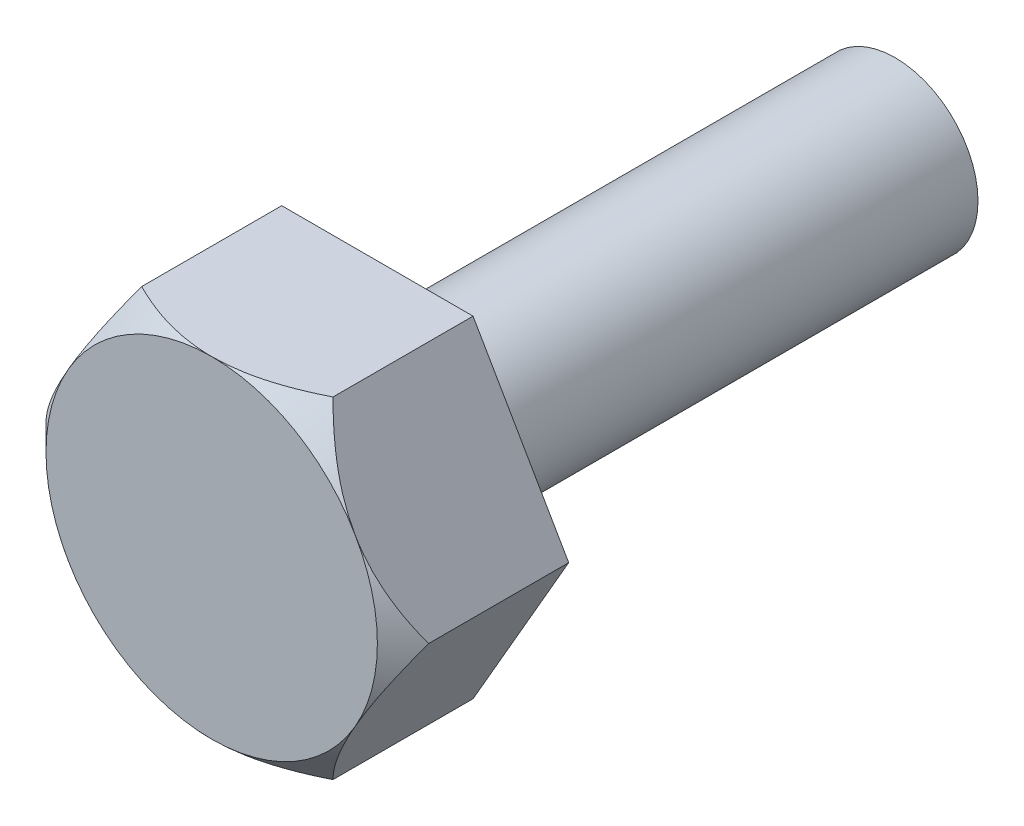
ISO-10303-21;
HEADER;
FILE_DESCRIPTION(('STEP AP214'),'2;1');
FILE_NAME('part.step','',(''),(''),'','','');
FILE_SCHEMA(('AUTOMOTIVE_DESIGN { 1 0 10303 214 1 1 1 1 }'));
ENDSEC;
DATA;
#1=APPLICATION_CONTEXT('core data for automotive mechanical design processes');
#2=APPLICATION_PROTOCOL_DEFINITION('international standard','automotive_design',2000,#1);
#3=PRODUCT_CONTEXT('',#1,'mechanical');
#4=PRODUCT('Part','Part','',(#3));
#5=PRODUCT_RELATED_PRODUCT_CATEGORY('part','',(#4));
#6=PRODUCT_DEFINITION_FORMATION('','',#4);
#7=PRODUCT_DEFINITION_CONTEXT('part definition',#1,'design');
#8=PRODUCT_DEFINITION('design','',#6,#7);
#9=PRODUCT_DEFINITION_SHAPE('','',#8);
#10=(LENGTH_UNIT() NAMED_UNIT(*) SI_UNIT(.MILLI.,.METRE.));
#11=(NAMED_UNIT(*) PLANE_ANGLE_UNIT() SI_UNIT($,.RADIAN.));
#12=(NAMED_UNIT(*) SI_UNIT($,.STERADIAN.) SOLID_ANGLE_UNIT());
#13=UNCERTAINTY_MEASURE_WITH_UNIT(LENGTH_MEASURE(1.E-05),#10,'distance_accuracy_value','');
#14=(GEOMETRIC_REPRESENTATION_CONTEXT(3) GLOBAL_UNCERTAINTY_ASSIGNED_CONTEXT((#13)) GLOBAL_UNIT_ASSIGNED_CONTEXT((#10,
#11,#12)) REPRESENTATION_CONTEXT('',''));
#15=CARTESIAN_POINT('',(0.,0.,0.));
#16=DIRECTION('',(0.,0.,1.));
#17=DIRECTION('',(1.,0.,0.));
#18=AXIS2_PLACEMENT_3D('',#15,#16,#17);
#19=CARTESIAN_POINT('',(4.61880215351711,-7.99999999999997,8.));
#20=DIRECTION('',(-0.866025403784442,0.499999999999995,0.));
#21=DIRECTION('',(-0.499999999999995,-0.866025403784442,0.));
#22=AXIS2_PLACEMENT_3D('',#19,#20,#21);
#23=PLANE('',#22);
#24=CARTESIAN_POINT('',(4.61868668346327,-8.00019999999997,6.76228022074711));
#25=CARTESIAN_POINT('',(4.69810283620521,-7.86264718850928,6.8416874314488));
#26=CARTESIAN_POINT('',(4.77812941419865,-7.72403708946876,6.91865771912576));
#27=CARTESIAN_POINT('',(4.93952317146405,-7.44449490186065,7.06698316123685));
#28=CARTESIAN_POINT('',(5.02089105397501,-7.30356159524737,7.13833524901212));
#29=CARTESIAN_POINT('',(5.26794216580374,-6.87565651749363,7.34346070715147));
#30=CARTESIAN_POINT('',(5.4357167691807,-6.58506238022501,7.46742824260941));
#31=CARTESIAN_POINT('',(5.77404764616582,-5.99905611151743,7.67971394035747));
#32=CARTESIAN_POINT('',(5.94451745062627,-5.70379374903561,7.76856690541008));
#33=CARTESIAN_POINT('',(6.20302465258088,-5.25604614112774,7.87134783396542));
#34=CARTESIAN_POINT('',(6.2895743025914,-5.10613774993222,7.90051131274916));
#35=CARTESIAN_POINT('',(6.46340640161736,-4.80505172243291,7.94801217287629));
#36=CARTESIAN_POINT('',(6.55068873914739,-4.65387427922752,7.96635117203458));
#37=CARTESIAN_POINT('',(6.76338552157141,-4.28547264546268,7.99709931914368));
#38=CARTESIAN_POINT('',(6.88902914152176,-4.0678515120618,8.00355065486675));
#39=CARTESIAN_POINT('',(7.14008990906258,-3.63300150689385,7.99272107586606));
#40=CARTESIAN_POINT('',(7.26550696183974,-3.41577279934827,7.97543184224073));
#41=CARTESIAN_POINT('',(7.51515863543799,-2.98336341648149,7.91814025921819));
#42=CARTESIAN_POINT('',(7.63939177578743,-2.76818530541242,7.8781125110308));
#43=CARTESIAN_POINT('',(7.88572278505966,-2.34152748187319,7.77752005239399));
#44=CARTESIAN_POINT('',(8.00782081696484,-2.13004748710926,7.71695691676235));
#45=CARTESIAN_POINT('',(8.22456323750447,-1.75463860257914,7.59236205646226));
#46=CARTESIAN_POINT('',(8.31968762734991,-1.58987832632785,7.53160757067224));
#47=CARTESIAN_POINT('',(8.50822887423362,-1.26331530740288,7.40030853879354));
#48=CARTESIAN_POINT('',(8.60164567946201,-1.10151265446654,7.32976369621156));
#49=CARTESIAN_POINT('',(8.78647752030848,-0.781374515263961,7.18046522287584));
#50=CARTESIAN_POINT('',(8.87789781257286,-0.623029924219245,7.10173740752231));
#51=CARTESIAN_POINT('',(9.0590456117528,-0.309272732360308,6.93710651869467));
#52=CARTESIAN_POINT('',(9.1487741158549,-0.153858404368316,6.8512078450081));
#53=CARTESIAN_POINT('',(9.23771977708787,0.000199999999999306,6.76228022074711));
#54=B_SPLINE_CURVE_WITH_KNOTS('',3,(#24,#25,#26,#27,#28,#29,#30,#31,#32,#33,#34,#35,#36,#37,#38,
#39,#40,#41,#42,#43,#44,#45,#46,#47,#48,#49,#50,#51,#52,#53),.UNSPECIFIED.,.F.,.F.,(4,2,2,2,2,2,
2,2,2,2,2,2,2,2,4),(0.,0.532696580390586,1.06568194267352,2.13740664213604,3.19211397028661,
3.71843331125693,4.24467396918196,4.99761238034702,5.75081469500554,6.50485999129142,
7.25884747442538,7.85770857481701,8.45658781520814,9.05363199316839,9.65031250088055),.UNSPECIFIED.);
#55=CARTESIAN_POINT('',(4.61880215351711,-7.99999999999997,6.76239569296598));
#56=VERTEX_POINT('',#55);
#57=CARTESIAN_POINT('',(6.92820323027555,-3.99999999999997,8.));
#58=VERTEX_POINT('',#57);
#59=EDGE_CURVE('E206',#56,#58,#54,.T.);
#60=ORIENTED_EDGE('',*,*,#59,.F.);
#61=DIRECTION('',(0.,0.,-1.));
#62=VECTOR('',#61,1.);
#63=CARTESIAN_POINT('',(4.61880215351711,-7.99999999999997,8.));
#64=LINE('',#63,#62);
#65=CARTESIAN_POINT('',(4.61880215351711,-7.99999999999997,0.));
#66=VERTEX_POINT('',#65);
#67=EDGE_CURVE('E191',#56,#66,#64,.T.);
#68=ORIENTED_EDGE('',*,*,#67,.T.);
#69=DIRECTION('',(0.499999999999995,0.866025403784442,0.));
#70=VECTOR('',#69,1.);
#71=CARTESIAN_POINT('',(4.61880215351711,-7.99999999999997,0.));
#72=LINE('',#71,#70);
#73=CARTESIAN_POINT('',(9.23760430703403,0.,0.));
#74=VERTEX_POINT('',#73);
#75=EDGE_CURVE('E180',#66,#74,#72,.T.);
#76=ORIENTED_EDGE('',*,*,#75,.T.);
#77=DIRECTION('',(0.,0.,-1.));
#78=VECTOR('',#77,1.);
#79=CARTESIAN_POINT('',(9.23760430703403,0.,8.));
#80=LINE('',#79,#78);
#81=CARTESIAN_POINT('',(9.23760430703403,0.,6.76239569296598));
#82=VERTEX_POINT('',#81);
#83=EDGE_CURVE('E172',#82,#74,#80,.T.);
#84=ORIENTED_EDGE('',*,*,#83,.F.);
#85=EDGE_CURVE('E175',#58,#82,#54,.T.);
#86=ORIENTED_EDGE('',*,*,#85,.F.);
#87=EDGE_LOOP('',(#60,#68,#76,#84,#86));
#88=FACE_BOUND('',#87,.T.);
#89=ADVANCED_FACE('F34',(#88),#23,.F.);
#90=CARTESIAN_POINT('',(9.23760430703403,0.,8.));
#91=DIRECTION('',(-0.866025403784438,-0.500000000000001,0.));
#92=DIRECTION('',(0.500000000000001,-0.866025403784438,0.));
#93=AXIS2_PLACEMENT_3D('',#90,#91,#92);
#94=PLANE('',#93);
#95=CARTESIAN_POINT('',(9.23771977708787,-0.000200000000000087,6.76228022074711));
#96=CARTESIAN_POINT('',(9.15830362434594,0.137352811490686,6.84168743144881));
#97=CARTESIAN_POINT('',(9.07827704635249,0.275962910531208,6.91865771912576));
#98=CARTESIAN_POINT('',(8.91688328908709,0.555505098139325,7.06698316123686));
#99=CARTESIAN_POINT('',(8.83551540657612,0.696438404752605,7.13833524901213));
#100=CARTESIAN_POINT('',(8.58846429474739,1.12434348250634,7.34346070715149));
#101=CARTESIAN_POINT('',(8.42068969137043,1.41493761977497,7.46742824260942));
#102=CARTESIAN_POINT('',(8.0823588143853,2.00094388848255,7.67971394035749));
#103=CARTESIAN_POINT('',(7.91188900992485,2.29620625096437,7.7685669054101));
#104=CARTESIAN_POINT('',(7.65338180797023,2.74395385887224,7.87134783396545));
#105=CARTESIAN_POINT('',(7.56683215795971,2.89386225006776,7.90051131274918));
#106=CARTESIAN_POINT('',(7.39300005893375,3.19494827756708,7.94801217287632));
#107=CARTESIAN_POINT('',(7.30571772140372,3.34612572077247,7.96635117203461));
#108=CARTESIAN_POINT('',(7.09302093897969,3.71452735453731,7.99709931914371));
#109=CARTESIAN_POINT('',(6.96737731902934,3.93214848793819,8.00355065486679));
#110=CARTESIAN_POINT('',(6.71631655148851,4.36699849310614,7.9927210758661));
#111=CARTESIAN_POINT('',(6.59089949871136,4.58422720065172,7.97543184224076));
#112=CARTESIAN_POINT('',(6.3412478251131,5.0166365835185,7.91814025921822));
#113=CARTESIAN_POINT('',(6.21701468476366,5.23181469458756,7.87811251103084));
#114=CARTESIAN_POINT('',(5.97068367549142,5.65847251812679,7.77752005239402));
#115=CARTESIAN_POINT('',(5.84858564358625,5.86995251289072,7.71695691676238));
#116=CARTESIAN_POINT('',(5.63184322304661,6.24536139742084,7.59236205646229));
#117=CARTESIAN_POINT('',(5.53671883320116,6.41012167367214,7.53160757067227));
#118=CARTESIAN_POINT('',(5.34817758631745,6.73668469259711,7.40030853879357));
#119=CARTESIAN_POINT('',(5.25476078108905,6.89848734553347,7.32976369621158));
#120=CARTESIAN_POINT('',(5.06992894024257,7.21862548473605,7.18046522287586));
#121=CARTESIAN_POINT('',(4.97850864797818,7.37697007578077,7.10173740752232));
#122=CARTESIAN_POINT('',(4.79736084879824,7.69072726763971,6.93710651869468));
#123=CARTESIAN_POINT('',(4.70763234469614,7.84614159563171,6.8512078450081));
#124=CARTESIAN_POINT('',(4.61868668346316,8.00020000000003,6.76228022074711));
#125=B_SPLINE_CURVE_WITH_KNOTS('',3,(#95,#96,#97,#98,#99,#100,#101,#102,#103,#104,#105,#106,
#107,#108,#109,#110,#111,#112,#113,#114,#115,#116,#117,#118,#119,#120,#121,#122,#123,#124),
.UNSPECIFIED.,.F.,.F.,(4,2,2,2,2,2,2,2,2,2,2,2,2,2,4),(0.,0.532696580390592,1.06568194267354,
2.13740664213607,3.19211397028665,3.71843331125698,4.24467396918202,4.99761238034707,
5.75081469500559,6.50485999129147,7.25884747442542,7.85770857481708,8.45658781520823,
9.05363199316849,9.65031250088068),.UNSPECIFIED.);
#126=CARTESIAN_POINT('',(6.92820323027552,4.00000000000002,8.));
#127=VERTEX_POINT('',#126);
#128=EDGE_CURVE('E169',#82,#127,#125,.T.);
#129=ORIENTED_EDGE('',*,*,#128,.F.);
#130=ORIENTED_EDGE('',*,*,#83,.T.);
#131=DIRECTION('',(-0.500000000000001,0.866025403784438,0.));
#132=VECTOR('',#131,1.);
#133=CARTESIAN_POINT('',(9.23760430703403,0.,0.));
#134=LINE('',#133,#132);
#135=CARTESIAN_POINT('',(4.618802153517,8.00000000000003,0.));
#136=VERTEX_POINT('',#135);
#137=EDGE_CURVE('E204',#74,#136,#134,.T.);
#138=ORIENTED_EDGE('',*,*,#137,.T.);
#139=DIRECTION('',(0.,0.,-1.));
#140=VECTOR('',#139,1.);
#141=CARTESIAN_POINT('',(4.618802153517,8.00000000000003,8.));
#142=LINE('',#141,#140);
#143=CARTESIAN_POINT('',(4.618802153517,8.00000000000003,6.76239569296598));
#144=VERTEX_POINT('',#143);
#145=EDGE_CURVE('E181',#144,#136,#142,.T.);
#146=ORIENTED_EDGE('',*,*,#145,.F.);
#147=EDGE_CURVE('E109',#127,#144,#125,.T.);
#148=ORIENTED_EDGE('',*,*,#147,.F.);
#149=EDGE_LOOP('',(#129,#130,#138,#146,#148));
#150=FACE_BOUND('',#149,.T.);
#151=ADVANCED_FACE('F158',(#150),#94,.F.);
#152=CARTESIAN_POINT('',(4.618802153517,8.00000000000003,8.));
#153=DIRECTION('',(0.,-1.,0.));
#154=DIRECTION('',(1.,0.,0.));
#155=AXIS2_PLACEMENT_3D('',#152,#153,#154);
#156=PLANE('',#155);
#157=CARTESIAN_POINT('',(-9.90735337154558,7.99999999999998,3.26596486463641));
#158=CARTESIAN_POINT('',(-9.66899419870726,7.99999999999998,3.45137216903188));
#159=CARTESIAN_POINT('',(-9.4293816705094,7.99999999999998,3.63519293654936));
#160=CARTESIAN_POINT('',(-8.94712690798016,7.99999999999998,3.99892790109922));
#161=CARTESIAN_POINT('',(-8.70448399491294,7.99999999999998,4.17884119730549));
#162=CARTESIAN_POINT('',(-8.21387665802133,7.99999999999999,4.53530630850535));
#163=CARTESIAN_POINT('',(-7.96588567392815,7.99999999999999,4.71182168512483));
#164=CARTESIAN_POINT('',(-7.46583122261189,7.99999999999999,5.05896585988633));
#165=CARTESIAN_POINT('',(-7.21376803381859,7.99999999999999,5.2295950580052));
#166=CARTESIAN_POINT('',(-6.68771297801765,7.99999999999999,5.57486288574435));
#167=CARTESIAN_POINT('',(-6.41338812904468,7.99999999999999,5.74899670492355));
#168=CARTESIAN_POINT('',(-5.85828191388777,7.99999999999999,6.08682997623795));
#169=CARTESIAN_POINT('',(-5.57749943394259,8.,6.25052760977707));
#170=CARTESIAN_POINT('',(-5.00933840447951,8.,6.56403168694934));
#171=CARTESIAN_POINT('',(-4.72198247770295,8.,6.71387880939743));
#172=CARTESIAN_POINT('',(-4.13898152402991,8.,6.99632395271653));
#173=CARTESIAN_POINT('',(-3.84334058421329,8.,7.12893030270274));
#174=CARTESIAN_POINT('',(-3.27572283201751,8.,7.3587838610153));
#175=CARTESIAN_POINT('',(-3.00467807970942,8.,7.45830955195261));
#176=CARTESIAN_POINT('',(-2.45545348007035,8.00000000000001,7.6356845156304));
#177=CARTESIAN_POINT('',(-2.17727319843915,8.00000000000001,7.7135324655314));
#178=CARTESIAN_POINT('',(-1.62042587224299,8.00000000000001,7.84194003063979));
#179=CARTESIAN_POINT('',(-1.34187931307557,8.00000000000001,7.89301318554612));
#180=CARTESIAN_POINT('',(-0.781030848125404,8.00000000000001,7.96676539420259));
#181=CARTESIAN_POINT('',(-0.498729829949346,8.00000000000001,7.98945104266813));
#182=CARTESIAN_POINT('',(0.0528815056378612,8.00000000000002,8.00434412604387));
#183=CARTESIAN_POINT('',(0.322153254391752,8.00000000000002,7.99798532326465));
#184=CARTESIAN_POINT('',(0.858712847584029,8.00000000000002,7.95849745814185));
#185=CARTESIAN_POINT('',(1.12600051859528,8.00000000000002,7.92536608279378));
#186=CARTESIAN_POINT('',(1.66119839461076,8.00000000000002,7.83368407918551));
#187=CARTESIAN_POINT('',(1.92902855537421,8.00000000000002,7.77467432016543));
#188=CARTESIAN_POINT('',(2.45874425910021,8.00000000000002,7.63458879946231));
#189=CARTESIAN_POINT('',(2.72063003451434,8.00000000000003,7.55351390223924));
#190=CARTESIAN_POINT('',(3.24784564176125,8.00000000000003,7.36952467083769));
#191=CARTESIAN_POINT('',(3.51292140781402,8.00000000000003,7.26589111043137));
#192=CARTESIAN_POINT('',(4.03628266295484,8.00000000000003,7.04257187134359));
#193=CARTESIAN_POINT('',(4.29456508089651,8.00000000000003,6.92287907684813));
#194=CARTESIAN_POINT('',(4.80553971289152,8.00000000000003,6.67027690364054));
#195=CARTESIAN_POINT('',(5.05821185232669,8.00000000000003,6.53732724850851));
#196=CARTESIAN_POINT('',(5.55777698271017,8.00000000000003,6.26113065350248));
#197=CARTESIAN_POINT('',(5.80467084173997,8.00000000000004,6.11788527370926));
#198=CARTESIAN_POINT('',(6.28138885065664,8.00000000000004,5.83036305367367));
#199=CARTESIAN_POINT('',(6.51145467111952,8.00000000000004,5.68648478936937));
#200=CARTESIAN_POINT('',(6.96763273637398,8.00000000000004,5.39257361293732));
#201=CARTESIAN_POINT('',(7.19374468475172,8.00000000000004,5.24254024217097));
#202=CARTESIAN_POINT('',(7.64072258710934,8.00000000000004,4.93862802201295));
#203=CARTESIAN_POINT('',(7.8616160078914,8.00000000000004,4.78478942389008));
#204=CARTESIAN_POINT('',(8.30036793825375,8.00000000000004,4.47296519667524));
#205=CARTESIAN_POINT('',(8.51822726795434,8.00000000000004,4.31498072288254));
#206=CARTESIAN_POINT('',(8.73481288858656,8.00000000000004,4.15529839132206));
#207=B_SPLINE_CURVE_WITH_KNOTS('',3,(#157,#158,#159,#160,#161,#162,#163,#164,#165,#166,#167,
#168,#169,#170,#171,#172,#173,#174,#175,#176,#177,#178,#179,#180,#181,#182,#183,#184,#185,#186,
#187,#188,#189,#190,#191,#192,#193,#194,#195,#196,#197,#198,#199,#200,#201,#202,#203,#204,#205,
#206),.UNSPECIFIED.,.F.,.F.,(4,2,2,2,2,2,2,2,2,2,2,2,2,2,2,2,2,2,2,2,2,2,2,2,4),(0.,
0.905951093339931,1.81210887346184,2.72522749578353,3.63828394726991,4.61287649129192,
5.58763840493098,6.55943988237551,7.53077011856275,8.39625060926844,9.26178390256947,
10.1100454721513,10.9581099450704,11.7647753692904,12.5715104924624,13.3931773445249,
14.2148120102552,15.0680049018495,15.9215770977374,16.7778265294731,17.6339464886831,
18.447884116994,19.2618825052058,20.0693838604163,20.8766625360825),.UNSPECIFIED.);
#208=CARTESIAN_POINT('',(0.,8.00000000000002,8.));
#209=VERTEX_POINT('',#208);
#210=EDGE_CURVE('E105',#144,#209,#207,.F.);
#211=ORIENTED_EDGE('',*,*,#210,.F.);
#212=ORIENTED_EDGE('',*,*,#145,.T.);
#213=DIRECTION('',(-1.,0.,0.));
#214=VECTOR('',#213,1.);
#215=CARTESIAN_POINT('',(4.618802153517,8.00000000000003,0.));
#216=LINE('',#215,#214);
#217=CARTESIAN_POINT('',(-4.61880215351705,8.,0.));
#218=VERTEX_POINT('',#217);
#219=EDGE_CURVE('E202',#136,#218,#216,.T.);
#220=ORIENTED_EDGE('',*,*,#219,.T.);
#221=DIRECTION('',(0.,0.,-1.));
#222=VECTOR('',#221,1.);
#223=CARTESIAN_POINT('',(-4.61880215351705,8.,8.));
#224=LINE('',#223,#222);
#225=CARTESIAN_POINT('',(-4.61880215351705,8.,6.76239569296598));
#226=VERTEX_POINT('',#225);
#227=EDGE_CURVE('E133',#226,#218,#224,.T.);
#228=ORIENTED_EDGE('',*,*,#227,.F.);
#229=EDGE_CURVE('E113',#209,#226,#207,.F.);
#230=ORIENTED_EDGE('',*,*,#229,.F.);
#231=EDGE_LOOP('',(#211,#212,#220,#228,#230));
#232=FACE_BOUND('',#231,.T.);
#233=ADVANCED_FACE('F131',(#232),#156,.F.);
#234=CARTESIAN_POINT('',(-4.61880215351705,8.,8.));
#235=DIRECTION('',(0.866025403784441,-0.499999999999995,0.));
#236=DIRECTION('',(0.499999999999995,0.866025403784442,0.));
#237=AXIS2_PLACEMENT_3D('',#234,#235,#236);
#238=PLANE('',#237);
#239=CARTESIAN_POINT('',(-4.61868668346322,8.0002,6.76228022074711));
#240=CARTESIAN_POINT('',(-4.69810283620515,7.86264718850931,6.84168743144881));
#241=CARTESIAN_POINT('',(-4.7781294141986,7.72403708946879,6.91865771912576));
#242=CARTESIAN_POINT('',(-4.939523171464,7.44449490186067,7.06698316123686));
#243=CARTESIAN_POINT('',(-5.02089105397496,7.30356159524739,7.13833524901213));
#244=CARTESIAN_POINT('',(-5.26794216580369,6.87565651749365,7.34346070715149));
#245=CARTESIAN_POINT('',(-5.43571676918065,6.58506238022502,7.46742824260942));
#246=CARTESIAN_POINT('',(-5.77404764616578,5.99905611151744,7.67971394035749));
#247=CARTESIAN_POINT('',(-5.94451745062622,5.70379374903561,7.7685669054101));
#248=CARTESIAN_POINT('',(-6.20302465258084,5.25604614112774,7.87134783396545));
#249=CARTESIAN_POINT('',(-6.28957430259136,5.10613774993222,7.90051131274918));
#250=CARTESIAN_POINT('',(-6.46340640161732,4.80505172243291,7.94801217287632));
#251=CARTESIAN_POINT('',(-6.55068873914735,4.65387427922751,7.96635117203461));
#252=CARTESIAN_POINT('',(-6.76338552157138,4.28547264546267,7.99709931914371));
#253=CARTESIAN_POINT('',(-6.88902914152173,4.06785151206179,8.00355065486678));
#254=CARTESIAN_POINT('',(-7.14008990906255,3.63300150689384,7.9927210758661));
#255=CARTESIAN_POINT('',(-7.2655069618397,3.41577279934826,7.97543184224076));
#256=CARTESIAN_POINT('',(-7.51515863543796,2.98336341648148,7.91814025921822));
#257=CARTESIAN_POINT('',(-7.6393917757874,2.76818530541242,7.87811251103084));
#258=CARTESIAN_POINT('',(-7.88572278505963,2.34152748187319,7.77752005239402));
#259=CARTESIAN_POINT('',(-8.0078208169648,2.13004748710925,7.71695691676238));
#260=CARTESIAN_POINT('',(-8.22456323750444,1.75463860257913,7.5923620564623));
#261=CARTESIAN_POINT('',(-8.31968762734989,1.58987832632783,7.53160757067227));
#262=CARTESIAN_POINT('',(-8.50822887423359,1.26331530740286,7.40030853879357));
#263=CARTESIAN_POINT('',(-8.60164567946199,1.1015126544665,7.32976369621158));
#264=CARTESIAN_POINT('',(-8.78647752030847,0.781374515263918,7.18046522287586));
#265=CARTESIAN_POINT('',(-8.87789781257286,0.623029924219198,7.10173740752232));
#266=CARTESIAN_POINT('',(-9.0590456117528,0.309272732360253,6.93710651869468));
#267=CARTESIAN_POINT('',(-9.1487741158549,0.153858404368255,6.8512078450081));
#268=CARTESIAN_POINT('',(-9.23771977708787,-0.000200000000064894,6.76228022074711));
#269=B_SPLINE_CURVE_WITH_KNOTS('',3,(#239,#240,#241,#242,#243,#244,#245,#246,#247,#248,#249,
#250,#251,#252,#253,#254,#255,#256,#257,#258,#259,#260,#261,#262,#263,#264,#265,#266,#267,#268),
.UNSPECIFIED.,.F.,.F.,(4,2,2,2,2,2,2,2,2,2,2,2,2,2,4),(0.,0.532696580390591,1.06568194267354,
2.13740664213607,3.19211397028666,3.71843331125698,4.24467396918202,4.99761238034707,
5.75081469500559,6.50485999129147,7.25884747442543,7.85770857481708,8.45658781520823,
9.0536319931685,9.65031250088068),.UNSPECIFIED.);
#270=CARTESIAN_POINT('',(-6.92820323027555,3.99999999999997,8.));
#271=VERTEX_POINT('',#270);
#272=EDGE_CURVE('E119',#226,#271,#269,.T.);
#273=ORIENTED_EDGE('',*,*,#272,.F.);
#274=ORIENTED_EDGE('',*,*,#227,.T.);
#275=DIRECTION('',(-0.499999999999995,-0.866025403784441,0.));
#276=VECTOR('',#275,1.);
#277=CARTESIAN_POINT('',(-4.61880215351705,8.,0.));
#278=LINE('',#277,#276);
#279=CARTESIAN_POINT('',(-9.23760430703403,0.,0.));
#280=VERTEX_POINT('',#279);
#281=EDGE_CURVE('E199',#218,#280,#278,.T.);
#282=ORIENTED_EDGE('',*,*,#281,.T.);
#283=DIRECTION('',(0.,0.,-1.));
#284=VECTOR('',#283,1.);
#285=CARTESIAN_POINT('',(-9.23760430703403,0.,8.));
#286=LINE('',#285,#284);
#287=CARTESIAN_POINT('',(-9.23760430703403,0.,6.76239569296598));
#288=VERTEX_POINT('',#287);
#289=EDGE_CURVE('E187',#288,#280,#286,.T.);
#290=ORIENTED_EDGE('',*,*,#289,.F.);
#291=EDGE_CURVE('E134',#271,#288,#269,.T.);
#292=ORIENTED_EDGE('',*,*,#291,.F.);
#293=EDGE_LOOP('',(#273,#274,#282,#290,#292));
#294=FACE_BOUND('',#293,.T.);
#295=ADVANCED_FACE('F157',(#294),#238,.F.);
#296=CARTESIAN_POINT('',(-9.23760430703403,0.,8.));
#297=DIRECTION('',(0.866025403784434,0.500000000000007,0.));
#298=DIRECTION('',(-0.500000000000007,0.866025403784435,0.));
#299=AXIS2_PLACEMENT_3D('',#296,#297,#298);
#300=PLANE('',#299);
#301=CARTESIAN_POINT('',(-9.23771977708787,0.00019999999993558,6.76228022074711));
#302=CARTESIAN_POINT('',(-9.15830362434594,-0.137352811490749,6.84168743144881));
#303=CARTESIAN_POINT('',(-9.07827704635249,-0.275962910531271,6.91865771912576));
#304=CARTESIAN_POINT('',(-8.91688328908708,-0.555505098139387,7.06698316123686));
#305=CARTESIAN_POINT('',(-8.83551540657612,-0.696438404752668,7.13833524901213));
#306=CARTESIAN_POINT('',(-8.58846429474739,-1.1243434825064,7.34346070715149));
#307=CARTESIAN_POINT('',(-8.42068969137042,-1.41493761977503,7.46742824260942));
#308=CARTESIAN_POINT('',(-8.08235881438528,-2.00094388848261,7.67971394035749));
#309=CARTESIAN_POINT('',(-7.91188900992483,-2.29620625096443,7.7685669054101));
#310=CARTESIAN_POINT('',(-7.65338180797021,-2.7439538588723,7.87134783396545));
#311=CARTESIAN_POINT('',(-7.56683215795969,-2.89386225006782,7.90051131274918));
#312=CARTESIAN_POINT('',(-7.39300005893372,-3.19494827756713,7.94801217287632));
#313=CARTESIAN_POINT('',(-7.30571772140369,-3.34612572077252,7.96635117203462));
#314=CARTESIAN_POINT('',(-7.09302093897966,-3.71452735453736,7.99709931914371));
#315=CARTESIAN_POINT('',(-6.96737731902931,-3.93214848793824,8.00355065486679));
#316=CARTESIAN_POINT('',(-6.71631655148848,-4.36699849310619,7.9927210758661));
#317=CARTESIAN_POINT('',(-6.59089949871132,-4.58422720065176,7.97543184224076));
#318=CARTESIAN_POINT('',(-6.34124782511306,-5.01663658351854,7.91814025921822));
#319=CARTESIAN_POINT('',(-6.21701468476362,-5.23181469458761,7.87811251103084));
#320=CARTESIAN_POINT('',(-5.97068367549138,-5.65847251812683,7.77752005239403));
#321=CARTESIAN_POINT('',(-5.8485856435862,-5.86995251289076,7.71695691676238));
#322=CARTESIAN_POINT('',(-5.63184322304656,-6.24536139742088,7.5923620564623));
#323=CARTESIAN_POINT('',(-5.53671883320111,-6.41012167367218,7.53160757067227));
#324=CARTESIAN_POINT('',(-5.3481775863174,-6.73668469259715,7.40030853879357));
#325=CARTESIAN_POINT('',(-5.254760781089,-6.8984873455335,7.32976369621158));
#326=CARTESIAN_POINT('',(-5.06992894024252,-7.21862548473609,7.18046522287586));
#327=CARTESIAN_POINT('',(-4.97850864797813,-7.37697007578081,7.10173740752232));
#328=CARTESIAN_POINT('',(-4.79736084879818,-7.69072726763975,6.93710651869468));
#329=CARTESIAN_POINT('',(-4.70763234469608,-7.84614159563175,6.8512078450081));
#330=CARTESIAN_POINT('',(-4.6186866834631,-8.00020000000007,6.76228022074711));
#331=B_SPLINE_CURVE_WITH_KNOTS('',3,(#301,#302,#303,#304,#305,#306,#307,#308,#309,#310,#311,
#312,#313,#314,#315,#316,#317,#318,#319,#320,#321,#322,#323,#324,#325,#326,#327,#328,#329,#330),
.UNSPECIFIED.,.F.,.F.,(4,2,2,2,2,2,2,2,2,2,2,2,2,2,4),(0.,0.532696580390593,1.06568194267354,
2.13740664213607,3.19211397028666,3.71843331125698,4.24467396918202,4.99761238034707,
5.75081469500559,6.50485999129147,7.25884747442543,7.85770857481708,8.45658781520823,
9.0536319931685,9.65031250088068),.UNSPECIFIED.);
#332=CARTESIAN_POINT('',(-6.92820323027549,-4.00000000000006,8.));
#333=VERTEX_POINT('',#332);
#334=EDGE_CURVE('E222',#288,#333,#331,.T.);
#335=ORIENTED_EDGE('',*,*,#334,.F.);
#336=ORIENTED_EDGE('',*,*,#289,.T.);
#337=DIRECTION('',(0.500000000000007,-0.866025403784435,0.));
#338=VECTOR('',#337,1.);
#339=CARTESIAN_POINT('',(-9.23760430703403,0.,0.));
#340=LINE('',#339,#338);
#341=CARTESIAN_POINT('',(-4.61880215351694,-8.00000000000006,0.));
#342=VERTEX_POINT('',#341);
#343=EDGE_CURVE('E196',#280,#342,#340,.T.);
#344=ORIENTED_EDGE('',*,*,#343,.T.);
#345=DIRECTION('',(0.,0.,-1.));
#346=VECTOR('',#345,1.);
#347=CARTESIAN_POINT('',(-4.61880215351694,-8.00000000000006,8.));
#348=LINE('',#347,#346);
#349=CARTESIAN_POINT('',(-4.61880215351694,-8.00000000000006,6.76239569296598));
#350=VERTEX_POINT('',#349);
#351=EDGE_CURVE('E189',#350,#342,#348,.T.);
#352=ORIENTED_EDGE('',*,*,#351,.F.);
#353=EDGE_CURVE('E220',#333,#350,#331,.T.);
#354=ORIENTED_EDGE('',*,*,#353,.F.);
#355=EDGE_LOOP('',(#335,#336,#344,#352,#354));
#356=FACE_BOUND('',#355,.T.);
#357=ADVANCED_FACE('F221',(#356),#300,.F.);
#358=CARTESIAN_POINT('',(-4.61880215351694,-8.00000000000006,8.));
#359=DIRECTION('',(0.,1.,0.));
#360=DIRECTION('',(-1.,0.,0.));
#361=AXIS2_PLACEMENT_3D('',#358,#359,#360);
#362=PLANE('',#361);
#363=CARTESIAN_POINT('',(-9.90735337154547,-8.00000000000012,3.26596486463641));
#364=CARTESIAN_POINT('',(-9.66899419870714,-8.00000000000012,3.45137216903188));
#365=CARTESIAN_POINT('',(-9.42938167050929,-8.00000000000012,3.63519293654936));
#366=CARTESIAN_POINT('',(-8.94712690798004,-8.00000000000011,3.99892790109922));
#367=CARTESIAN_POINT('',(-8.70448399491282,-8.00000000000011,4.17884119730549));
#368=CARTESIAN_POINT('',(-8.21387665802121,-8.0000000000001,4.53530630850535));
#369=CARTESIAN_POINT('',(-7.96588567392804,-8.0000000000001,4.71182168512483));
#370=CARTESIAN_POINT('',(-7.46583122261177,-8.0000000000001,5.05896585988633));
#371=CARTESIAN_POINT('',(-7.21376803381847,-8.00000000000009,5.2295950580052));
#372=CARTESIAN_POINT('',(-6.68771297801754,-8.00000000000009,5.57486288574435));
#373=CARTESIAN_POINT('',(-6.41338812904457,-8.00000000000008,5.74899670492355));
#374=CARTESIAN_POINT('',(-5.85828191388766,-8.00000000000008,6.08682997623795));
#375=CARTESIAN_POINT('',(-5.57749943394248,-8.00000000000007,6.25052760977707));
#376=CARTESIAN_POINT('',(-5.0093384044794,-8.00000000000007,6.56403168694934));
#377=CARTESIAN_POINT('',(-4.72198247770284,-8.00000000000007,6.71387880939743));
#378=CARTESIAN_POINT('',(-4.1389815240298,-8.00000000000006,6.99632395271653));
#379=CARTESIAN_POINT('',(-3.84334058421318,-8.00000000000006,7.12893030270273));
#380=CARTESIAN_POINT('',(-3.2757228320174,-8.00000000000005,7.3587838610153));
#381=CARTESIAN_POINT('',(-3.00467807970931,-8.00000000000005,7.45830955195261));
#382=CARTESIAN_POINT('',(-2.45545348007024,-8.00000000000004,7.6356845156304));
#383=CARTESIAN_POINT('',(-2.17727319843904,-8.00000000000004,7.7135324655314));
#384=CARTESIAN_POINT('',(-1.62042587224287,-8.00000000000003,7.84194003063979));
#385=CARTESIAN_POINT('',(-1.34187931307545,-8.00000000000003,7.89301318554612));
#386=CARTESIAN_POINT('',(-0.781030848125291,-8.00000000000002,7.96676539420259));
#387=CARTESIAN_POINT('',(-0.498729829949233,-8.00000000000002,7.98945104266813));
#388=CARTESIAN_POINT('',(0.0528815056379743,-8.00000000000001,8.00434412604387));
#389=CARTESIAN_POINT('',(0.322153254391866,-8.00000000000001,7.99798532326465));
#390=CARTESIAN_POINT('',(0.858712847584142,-8.00000000000001,7.95849745814184));
#391=CARTESIAN_POINT('',(1.12600051859539,-8.,7.92536608279378));
#392=CARTESIAN_POINT('',(1.66119839461087,-8.,7.83368407918551));
#393=CARTESIAN_POINT('',(1.92902855537432,-8.,7.77467432016542));
#394=CARTESIAN_POINT('',(2.45874425910032,-7.99999999999999,7.63458879946231));
#395=CARTESIAN_POINT('',(2.72063003451446,-7.99999999999999,7.55351390223924));
#396=CARTESIAN_POINT('',(3.24784564176137,-7.99999999999998,7.36952467083768));
#397=CARTESIAN_POINT('',(3.51292140781413,-7.99999999999998,7.26589111043136));
#398=CARTESIAN_POINT('',(4.03628266295495,-7.99999999999997,7.04257187134358));
#399=CARTESIAN_POINT('',(4.29456508089663,-7.99999999999997,6.92287907684813));
#400=CARTESIAN_POINT('',(4.80553971289164,-7.99999999999997,6.67027690364054));
#401=CARTESIAN_POINT('',(5.05821185232681,-7.99999999999996,6.53732724850851));
#402=CARTESIAN_POINT('',(5.55777698271029,-7.99999999999996,6.26113065350248));
#403=CARTESIAN_POINT('',(5.80467084174009,-7.99999999999995,6.11788527370925));
#404=CARTESIAN_POINT('',(6.28138885065676,-7.99999999999995,5.83036305367366));
#405=CARTESIAN_POINT('',(6.51145467111964,-7.99999999999995,5.68648478936937));
#406=CARTESIAN_POINT('',(6.9676327363741,-7.99999999999994,5.39257361293731));
#407=CARTESIAN_POINT('',(7.19374468475184,-7.99999999999994,5.24254024217096));
#408=CARTESIAN_POINT('',(7.64072258710946,-7.99999999999994,4.93862802201294));
#409=CARTESIAN_POINT('',(7.86161600789152,-7.99999999999993,4.78478942389007));
#410=CARTESIAN_POINT('',(8.30036793825387,-7.99999999999993,4.47296519667524));
#411=CARTESIAN_POINT('',(8.51822726795447,-7.99999999999993,4.31498072288254));
#412=CARTESIAN_POINT('',(8.73481288858668,-7.99999999999992,4.15529839132205));
#413=B_SPLINE_CURVE_WITH_KNOTS('',3,(#363,#364,#365,#366,#367,#368,#369,#370,#371,#372,#373,
#374,#375,#376,#377,#378,#379,#380,#381,#382,#383,#384,#385,#386,#387,#388,#389,#390,#391,#392,
#393,#394,#395,#396,#397,#398,#399,#400,#401,#402,#403,#404,#405,#406,#407,#408,#409,#410,#411,
#412),.UNSPECIFIED.,.F.,.F.,(4,2,2,2,2,2,2,2,2,2,2,2,2,2,2,2,2,2,2,2,2,2,2,2,4),(0.,
0.905951093339932,1.81210887346183,2.72522749578353,3.63828394726991,4.61287649129192,
5.58763840493098,6.55943988237551,7.53077011856275,8.39625060926844,9.26178390256947,
10.1100454721513,10.9581099450704,11.7647753692904,12.5715104924624,13.3931773445249,
14.2148120102552,15.0680049018495,15.9215770977374,16.7778265294731,17.6339464886832,
18.447884116994,19.2618825052058,20.0693838604163,20.8766625360825),.UNSPECIFIED.);
#414=CARTESIAN_POINT('',(0.,-8.00000000000002,8.));
#415=VERTEX_POINT('',#414);
#416=EDGE_CURVE('E226',#350,#415,#413,.T.);
#417=ORIENTED_EDGE('',*,*,#416,.F.);
#418=ORIENTED_EDGE('',*,*,#351,.T.);
#419=DIRECTION('',(1.,0.,0.));
#420=VECTOR('',#419,1.);
#421=CARTESIAN_POINT('',(-4.61880215351694,-8.00000000000006,0.));
#422=LINE('',#421,#420);
#423=EDGE_CURVE('E193',#342,#66,#422,.T.);
#424=ORIENTED_EDGE('',*,*,#423,.T.);
#425=ORIENTED_EDGE('',*,*,#67,.F.);
#426=EDGE_CURVE('E127',#415,#56,#413,.T.);
#427=ORIENTED_EDGE('',*,*,#426,.F.);
#428=EDGE_LOOP('',(#417,#418,#424,#425,#427));
#429=FACE_BOUND('',#428,.T.);
#430=ADVANCED_FACE('F237',(#429),#362,.F.);
#431=CARTESIAN_POINT('',(0.,0.,0.));
#432=DIRECTION('',(0.,0.,1.));
#433=DIRECTION('',(1.,0.,0.));
#434=AXIS2_PLACEMENT_3D('',#431,#432,#433);
#435=PLANE('',#434);
#436=CARTESIAN_POINT('',(0.,0.,0.));
#437=DIRECTION('',(0.,0.,1.));
#438=DIRECTION('',(1.,0.,0.));
#439=AXIS2_PLACEMENT_3D('',#436,#437,#438);
#440=CIRCLE('',#439,4.);
#441=CARTESIAN_POINT('',(4.,0.,0.));
#442=VERTEX_POINT('',#441);
#443=EDGE_CURVE('E12',#442,#442,#440,.F.);
#444=ORIENTED_EDGE('',*,*,#443,.F.);
#445=EDGE_LOOP('',(#444));
#446=FACE_BOUND('',#445,.T.);
#447=ORIENTED_EDGE('',*,*,#75,.F.);
#448=ORIENTED_EDGE('',*,*,#423,.F.);
#449=ORIENTED_EDGE('',*,*,#343,.F.);
#450=ORIENTED_EDGE('',*,*,#281,.F.);
#451=ORIENTED_EDGE('',*,*,#219,.F.);
#452=ORIENTED_EDGE('',*,*,#137,.F.);
#453=EDGE_LOOP('',(#447,#448,#449,#450,#451,#452));
#454=FACE_BOUND('',#453,.T.);
#455=ADVANCED_FACE('F241',(#446,#454),#435,.F.);
#456=CARTESIAN_POINT('',(0.,0.,8.));
#457=DIRECTION('',(0.,0.,-1.));
#458=DIRECTION('',(1.,0.,0.));
#459=AXIS2_PLACEMENT_3D('',#456,#457,#458);
#460=CONICAL_SURFACE('',#459,8.00000000000002,0.78539816339745);
#461=ORIENTED_EDGE('',*,*,#85,.T.);
#462=ORIENTED_EDGE('',*,*,#128,.T.);
#463=CARTESIAN_POINT('',(0.,0.,8.));
#464=DIRECTION('',(0.,0.,1.));
#465=DIRECTION('',(1.,0.,0.));
#466=AXIS2_PLACEMENT_3D('',#463,#464,#465);
#467=CIRCLE('',#466,8.00000000000002);
#468=EDGE_CURVE('E123',#58,#127,#467,.T.);
#469=ORIENTED_EDGE('',*,*,#468,.F.);
#470=EDGE_LOOP('',(#461,#462,#469));
#471=FACE_BOUND('',#470,.T.);
#472=ADVANCED_FACE('F214',(#471),#460,.T.);
#473=ORIENTED_EDGE('',*,*,#59,.T.);
#474=EDGE_CURVE('E183',#415,#58,#467,.T.);
#475=ORIENTED_EDGE('',*,*,#474,.F.);
#476=ORIENTED_EDGE('',*,*,#426,.T.);
#477=EDGE_LOOP('',(#473,#475,#476));
#478=FACE_BOUND('',#477,.T.);
#479=ADVANCED_FACE('F151',(#478),#460,.T.);
#480=ORIENTED_EDGE('',*,*,#353,.T.);
#481=ORIENTED_EDGE('',*,*,#416,.T.);
#482=EDGE_CURVE('E57',#333,#415,#467,.T.);
#483=ORIENTED_EDGE('',*,*,#482,.F.);
#484=EDGE_LOOP('',(#480,#481,#483));
#485=FACE_BOUND('',#484,.T.);
#486=ADVANCED_FACE('F261',(#485),#460,.T.);
#487=ORIENTED_EDGE('',*,*,#291,.T.);
#488=ORIENTED_EDGE('',*,*,#334,.T.);
#489=EDGE_CURVE('E122',#271,#333,#467,.T.);
#490=ORIENTED_EDGE('',*,*,#489,.F.);
#491=EDGE_LOOP('',(#487,#488,#490));
#492=FACE_BOUND('',#491,.T.);
#493=ADVANCED_FACE('F256',(#492),#460,.T.);
#494=ORIENTED_EDGE('',*,*,#229,.T.);
#495=ORIENTED_EDGE('',*,*,#272,.T.);
#496=EDGE_CURVE('E42',#209,#271,#467,.T.);
#497=ORIENTED_EDGE('',*,*,#496,.F.);
#498=EDGE_LOOP('',(#494,#495,#497));
#499=FACE_BOUND('',#498,.T.);
#500=ADVANCED_FACE('F117',(#499),#460,.T.);
#501=ORIENTED_EDGE('',*,*,#147,.T.);
#502=ORIENTED_EDGE('',*,*,#210,.T.);
#503=CARTESIAN_POINT('',(0.,0.,8.));
#504=DIRECTION('',(0.,0.,1.));
#505=DIRECTION('',(1.,0.,0.));
#506=AXIS2_PLACEMENT_3D('',#503,#504,#505);
#507=CIRCLE('',#506,8.00000000000002);
#508=EDGE_CURVE('E49',#127,#209,#507,.T.);
#509=ORIENTED_EDGE('',*,*,#508,.F.);
#510=EDGE_LOOP('',(#501,#502,#509));
#511=FACE_BOUND('',#510,.T.);
#512=ADVANCED_FACE('F107',(#511),#460,.T.);
#513=CARTESIAN_POINT('',(0.,0.,8.));
#514=DIRECTION('',(0.,0.,1.));
#515=DIRECTION('',(1.,0.,0.));
#516=AXIS2_PLACEMENT_3D('',#513,#514,#515);
#517=PLANE('',#516);
#518=ORIENTED_EDGE('',*,*,#468,.T.);
#519=ORIENTED_EDGE('',*,*,#508,.T.);
#520=ORIENTED_EDGE('',*,*,#496,.T.);
#521=ORIENTED_EDGE('',*,*,#489,.T.);
#522=ORIENTED_EDGE('',*,*,#482,.T.);
#523=ORIENTED_EDGE('',*,*,#474,.T.);
#524=EDGE_LOOP('',(#518,#519,#520,#521,#522,#523));
#525=FACE_BOUND('',#524,.T.);
#526=ADVANCED_FACE('F125',(#525),#517,.T.);
#527=CARTESIAN_POINT('',(0.,0.,-25.));
#528=DIRECTION('',(0.,0.,1.));
#529=DIRECTION('',(1.,0.,0.));
#530=AXIS2_PLACEMENT_3D('',#527,#528,#529);
#531=CYLINDRICAL_SURFACE('',#530,4.);
#532=CARTESIAN_POINT('',(0.,0.,-25.));
#533=DIRECTION('',(0.,0.,-1.));
#534=DIRECTION('',(-1.,0.,0.));
#535=AXIS2_PLACEMENT_3D('',#532,#533,#534);
#536=CIRCLE('',#535,4.);
#537=CARTESIAN_POINT('',(-4.,0.,-25.));
#538=VERTEX_POINT('',#537);
#539=EDGE_CURVE('E128',#538,#538,#536,.T.);
#540=ORIENTED_EDGE('',*,*,#539,.F.);
#541=EDGE_LOOP('',(#540));
#542=FACE_BOUND('',#541,.T.);
#543=ORIENTED_EDGE('',*,*,#443,.T.);
#544=EDGE_LOOP('',(#543));
#545=FACE_BOUND('',#544,.T.);
#546=ADVANCED_FACE('F246',(#542,#545),#531,.T.);
#547=CARTESIAN_POINT('',(0.,0.,-25.));
#548=DIRECTION('',(0.,0.,-1.));
#549=DIRECTION('',(-1.,0.,0.));
#550=AXIS2_PLACEMENT_3D('',#547,#548,#549);
#551=PLANE('',#550);
#552=ORIENTED_EDGE('',*,*,#539,.T.);
#553=EDGE_LOOP('',(#552));
#554=FACE_BOUND('',#553,.T.);
#555=ADVANCED_FACE('F251',(#554),#551,.T.);
#556=CLOSED_SHELL('',(#89,#151,#233,#295,#357,#430,#455,#472,#479,#486,#493,#500,#512,#526,#546,#555));
#557=MANIFOLD_SOLID_BREP('B2',#556);
#558=ADVANCED_BREP_SHAPE_REPRESENTATION('',(#18,#557),#14);
#559=SHAPE_DEFINITION_REPRESENTATION(#9,#558);
ENDSEC;
END-ISO-10303-21;
